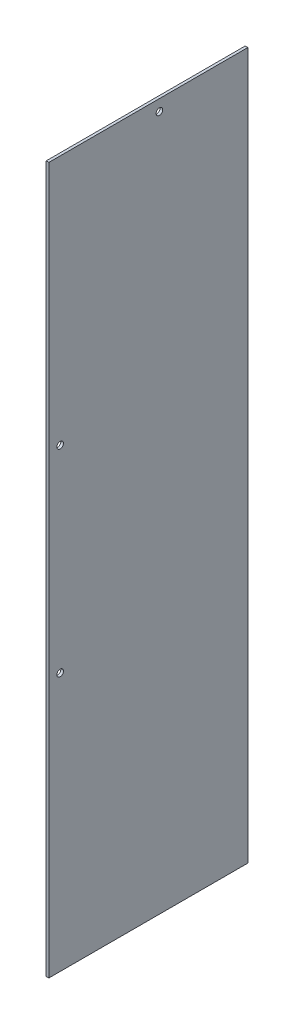
ISO-10303-21;
HEADER;
FILE_DESCRIPTION(('STEP AP214'),'2;1');
FILE_NAME('part.step','',(''),(''),'','','');
FILE_SCHEMA(('AUTOMOTIVE_DESIGN { 1 0 10303 214 1 1 1 1 }'));
ENDSEC;
DATA;
#1=APPLICATION_CONTEXT('core data for automotive mechanical design processes');
#2=APPLICATION_PROTOCOL_DEFINITION('international standard','automotive_design',2000,#1);
#3=PRODUCT_CONTEXT('',#1,'mechanical');
#4=PRODUCT('Part','Part','',(#3));
#5=PRODUCT_RELATED_PRODUCT_CATEGORY('part','',(#4));
#6=PRODUCT_DEFINITION_FORMATION('','',#4);
#7=PRODUCT_DEFINITION_CONTEXT('part definition',#1,'design');
#8=PRODUCT_DEFINITION('design','',#6,#7);
#9=PRODUCT_DEFINITION_SHAPE('','',#8);
#10=(LENGTH_UNIT() NAMED_UNIT(*) SI_UNIT(.MILLI.,.METRE.));
#11=(NAMED_UNIT(*) PLANE_ANGLE_UNIT() SI_UNIT($,.RADIAN.));
#12=(NAMED_UNIT(*) SI_UNIT($,.STERADIAN.) SOLID_ANGLE_UNIT());
#13=UNCERTAINTY_MEASURE_WITH_UNIT(LENGTH_MEASURE(1.E-05),#10,'distance_accuracy_value','');
#14=(GEOMETRIC_REPRESENTATION_CONTEXT(3) GLOBAL_UNCERTAINTY_ASSIGNED_CONTEXT((#13)) GLOBAL_UNIT_ASSIGNED_CONTEXT((#10,
#11,#12)) REPRESENTATION_CONTEXT('',''));
#15=CARTESIAN_POINT('',(0.,0.,0.));
#16=DIRECTION('',(0.,0.,1.));
#17=DIRECTION('',(1.,0.,0.));
#18=AXIS2_PLACEMENT_3D('',#15,#16,#17);
#19=CARTESIAN_POINT('',(3.0734,-406.5905,114.4905));
#20=DIRECTION('',(0.,0.,-1.));
#21=DIRECTION('',(-1.,0.,0.));
#22=AXIS2_PLACEMENT_3D('',#19,#20,#21);
#23=PLANE('',#22);
#24=DIRECTION('',(0.,-1.,0.));
#25=VECTOR('',#24,1.);
#26=CARTESIAN_POINT('',(0.,-406.5905,114.4905));
#27=LINE('',#26,#25);
#28=CARTESIAN_POINT('',(0.,406.5905,114.4905));
#29=VERTEX_POINT('',#28);
#30=CARTESIAN_POINT('',(0.,-406.5905,114.4905));
#31=VERTEX_POINT('',#30);
#32=EDGE_CURVE('E96',#29,#31,#27,.T.);
#33=ORIENTED_EDGE('',*,*,#32,.T.);
#34=DIRECTION('',(-1.,0.,0.));
#35=VECTOR('',#34,1.);
#36=CARTESIAN_POINT('',(3.0734,-406.5905,114.4905));
#37=LINE('',#36,#35);
#38=CARTESIAN_POINT('',(3.0734,-406.5905,114.4905));
#39=VERTEX_POINT('',#38);
#40=EDGE_CURVE('E11',#39,#31,#37,.T.);
#41=ORIENTED_EDGE('',*,*,#40,.F.);
#42=DIRECTION('',(0.,-1.,0.));
#43=VECTOR('',#42,1.);
#44=CARTESIAN_POINT('',(3.0734,-406.5905,114.4905));
#45=LINE('',#44,#43);
#46=CARTESIAN_POINT('',(3.0734,406.5905,114.4905));
#47=VERTEX_POINT('',#46);
#48=EDGE_CURVE('E84',#47,#39,#45,.T.);
#49=ORIENTED_EDGE('',*,*,#48,.F.);
#50=DIRECTION('',(-1.,0.,0.));
#51=VECTOR('',#50,1.);
#52=CARTESIAN_POINT('',(3.0734,406.5905,114.4905));
#53=LINE('',#52,#51);
#54=EDGE_CURVE('E92',#47,#29,#53,.T.);
#55=ORIENTED_EDGE('',*,*,#54,.T.);
#56=EDGE_LOOP('',(#33,#41,#49,#55));
#57=FACE_BOUND('',#56,.T.);
#58=ADVANCED_FACE('F33',(#57),#23,.F.);
#59=CARTESIAN_POINT('',(3.0734,-406.5905,-114.4905));
#60=DIRECTION('',(0.,1.,0.));
#61=DIRECTION('',(0.,0.,1.));
#62=AXIS2_PLACEMENT_3D('',#59,#60,#61);
#63=PLANE('',#62);
#64=DIRECTION('',(0.,0.,-1.));
#65=VECTOR('',#64,1.);
#66=CARTESIAN_POINT('',(0.,-406.5905,-114.4905));
#67=LINE('',#66,#65);
#68=CARTESIAN_POINT('',(0.,-406.5905,-114.4905));
#69=VERTEX_POINT('',#68);
#70=EDGE_CURVE('E88',#31,#69,#67,.T.);
#71=ORIENTED_EDGE('',*,*,#70,.T.);
#72=DIRECTION('',(-1.,0.,0.));
#73=VECTOR('',#72,1.);
#74=CARTESIAN_POINT('',(3.0734,-406.5905,-114.4905));
#75=LINE('',#74,#73);
#76=CARTESIAN_POINT('',(3.0734,-406.5905,-114.4905));
#77=VERTEX_POINT('',#76);
#78=EDGE_CURVE('E41',#77,#69,#75,.T.);
#79=ORIENTED_EDGE('',*,*,#78,.F.);
#80=DIRECTION('',(0.,0.,-1.));
#81=VECTOR('',#80,1.);
#82=CARTESIAN_POINT('',(3.0734,-406.5905,-114.4905));
#83=LINE('',#82,#81);
#84=EDGE_CURVE('E79',#39,#77,#83,.T.);
#85=ORIENTED_EDGE('',*,*,#84,.F.);
#86=ORIENTED_EDGE('',*,*,#40,.T.);
#87=EDGE_LOOP('',(#71,#79,#85,#86));
#88=FACE_BOUND('',#87,.T.);
#89=ADVANCED_FACE('F87',(#88),#63,.F.);
#90=CARTESIAN_POINT('',(3.0734,-406.5905,-114.4905));
#91=DIRECTION('',(0.,0.,1.));
#92=DIRECTION('',(1.,0.,0.));
#93=AXIS2_PLACEMENT_3D('',#90,#91,#92);
#94=PLANE('',#93);
#95=DIRECTION('',(0.,1.,0.));
#96=VECTOR('',#95,1.);
#97=CARTESIAN_POINT('',(0.,-406.5905,-114.4905));
#98=LINE('',#97,#96);
#99=CARTESIAN_POINT('',(0.,406.5905,-114.4905));
#100=VERTEX_POINT('',#99);
#101=EDGE_CURVE('E66',#69,#100,#98,.T.);
#102=ORIENTED_EDGE('',*,*,#101,.T.);
#103=DIRECTION('',(-1.,0.,0.));
#104=VECTOR('',#103,1.);
#105=CARTESIAN_POINT('',(3.0734,406.5905,-114.4905));
#106=LINE('',#105,#104);
#107=CARTESIAN_POINT('',(3.0734,406.5905,-114.4905));
#108=VERTEX_POINT('',#107);
#109=EDGE_CURVE('E89',#108,#100,#106,.T.);
#110=ORIENTED_EDGE('',*,*,#109,.F.);
#111=DIRECTION('',(0.,1.,0.));
#112=VECTOR('',#111,1.);
#113=CARTESIAN_POINT('',(3.0734,-406.5905,-114.4905));
#114=LINE('',#113,#112);
#115=EDGE_CURVE('E82',#77,#108,#114,.T.);
#116=ORIENTED_EDGE('',*,*,#115,.F.);
#117=ORIENTED_EDGE('',*,*,#78,.T.);
#118=EDGE_LOOP('',(#102,#110,#116,#117));
#119=FACE_BOUND('',#118,.T.);
#120=ADVANCED_FACE('F90',(#119),#94,.F.);
#121=CARTESIAN_POINT('',(3.0734,406.5905,-114.4905));
#122=DIRECTION('',(0.,-1.,0.));
#123=DIRECTION('',(0.,0.,-1.));
#124=AXIS2_PLACEMENT_3D('',#121,#122,#123);
#125=PLANE('',#124);
#126=DIRECTION('',(0.,0.,1.));
#127=VECTOR('',#126,1.);
#128=CARTESIAN_POINT('',(0.,406.5905,-114.4905));
#129=LINE('',#128,#127);
#130=EDGE_CURVE('E72',#100,#29,#129,.T.);
#131=ORIENTED_EDGE('',*,*,#130,.T.);
#132=ORIENTED_EDGE('',*,*,#54,.F.);
#133=DIRECTION('',(0.,0.,1.));
#134=VECTOR('',#133,1.);
#135=CARTESIAN_POINT('',(3.0734,406.5905,-114.4905));
#136=LINE('',#135,#134);
#137=EDGE_CURVE('E49',#108,#47,#136,.T.);
#138=ORIENTED_EDGE('',*,*,#137,.F.);
#139=ORIENTED_EDGE('',*,*,#109,.T.);
#140=EDGE_LOOP('',(#131,#132,#138,#139));
#141=FACE_BOUND('',#140,.T.);
#142=ADVANCED_FACE('F104',(#141),#125,.F.);
#143=CARTESIAN_POINT('',(3.0734,0.,0.));
#144=DIRECTION('',(1.,0.,0.));
#145=DIRECTION('',(0.,0.,-1.));
#146=AXIS2_PLACEMENT_3D('',#143,#144,#145);
#147=PLANE('',#146);
#148=CARTESIAN_POINT('',(3.0734,118.165033333333,101.5111));
#149=DIRECTION('',(1.,0.,0.));
#150=DIRECTION('',(0.,0.,-1.));
#151=AXIS2_PLACEMENT_3D('',#148,#149,#150);
#152=CIRCLE('',#151,3.81);
#153=CARTESIAN_POINT('',(3.0734,118.165033333333,97.7011));
#154=VERTEX_POINT('',#153);
#155=EDGE_CURVE('E119',#154,#154,#152,.T.);
#156=ORIENTED_EDGE('',*,*,#155,.F.);
#157=EDGE_LOOP('',(#156));
#158=FACE_BOUND('',#157,.T.);
#159=CARTESIAN_POINT('',(3.0734,-108.919433333333,101.5111));
#160=DIRECTION('',(1.,0.,0.));
#161=DIRECTION('',(0.,0.,-1.));
#162=AXIS2_PLACEMENT_3D('',#159,#160,#161);
#163=CIRCLE('',#162,3.81);
#164=CARTESIAN_POINT('',(3.0734,-108.919433333333,97.7011));
#165=VERTEX_POINT('',#164);
#166=EDGE_CURVE('E120',#165,#165,#163,.T.);
#167=ORIENTED_EDGE('',*,*,#166,.F.);
#168=EDGE_LOOP('',(#167));
#169=FACE_BOUND('',#168,.T.);
#170=CARTESIAN_POINT('',(3.0734,393.6111,-12.7889));
#171=DIRECTION('',(1.,0.,0.));
#172=DIRECTION('',(0.,0.,-1.));
#173=AXIS2_PLACEMENT_3D('',#170,#171,#172);
#174=CIRCLE('',#173,3.80999999999999);
#175=CARTESIAN_POINT('',(3.0734,393.6111,-16.5989));
#176=VERTEX_POINT('',#175);
#177=EDGE_CURVE('E112',#176,#176,#174,.T.);
#178=ORIENTED_EDGE('',*,*,#177,.F.);
#179=EDGE_LOOP('',(#178));
#180=FACE_BOUND('',#179,.T.);
#181=ORIENTED_EDGE('',*,*,#48,.T.);
#182=ORIENTED_EDGE('',*,*,#84,.T.);
#183=ORIENTED_EDGE('',*,*,#115,.T.);
#184=ORIENTED_EDGE('',*,*,#137,.T.);
#185=EDGE_LOOP('',(#181,#182,#183,#184));
#186=FACE_BOUND('',#185,.T.);
#187=ADVANCED_FACE('F80',(#158,#169,#180,#186),#147,.T.);
#188=CARTESIAN_POINT('',(0.,0.,0.));
#189=DIRECTION('',(1.,0.,0.));
#190=DIRECTION('',(0.,0.,-1.));
#191=AXIS2_PLACEMENT_3D('',#188,#189,#190);
#192=PLANE('',#191);
#193=CARTESIAN_POINT('',(0.,118.165033333333,101.5111));
#194=DIRECTION('',(1.,0.,0.));
#195=DIRECTION('',(0.,0.,-1.));
#196=AXIS2_PLACEMENT_3D('',#193,#194,#195);
#197=CIRCLE('',#196,3.81);
#198=CARTESIAN_POINT('',(0.,118.165033333333,97.7011));
#199=VERTEX_POINT('',#198);
#200=EDGE_CURVE('E115',#199,#199,#197,.F.);
#201=ORIENTED_EDGE('',*,*,#200,.F.);
#202=EDGE_LOOP('',(#201));
#203=FACE_BOUND('',#202,.T.);
#204=CARTESIAN_POINT('',(0.,-108.919433333333,101.5111));
#205=DIRECTION('',(1.,0.,0.));
#206=DIRECTION('',(0.,0.,-1.));
#207=AXIS2_PLACEMENT_3D('',#204,#205,#206);
#208=CIRCLE('',#207,3.81);
#209=CARTESIAN_POINT('',(0.,-108.919433333333,97.7011));
#210=VERTEX_POINT('',#209);
#211=EDGE_CURVE('E116',#210,#210,#208,.F.);
#212=ORIENTED_EDGE('',*,*,#211,.F.);
#213=EDGE_LOOP('',(#212));
#214=FACE_BOUND('',#213,.T.);
#215=CARTESIAN_POINT('',(0.,393.6111,-12.7889));
#216=DIRECTION('',(1.,0.,0.));
#217=DIRECTION('',(0.,0.,-1.));
#218=AXIS2_PLACEMENT_3D('',#215,#216,#217);
#219=CIRCLE('',#218,3.80999999999999);
#220=CARTESIAN_POINT('',(0.,393.6111,-16.5989));
#221=VERTEX_POINT('',#220);
#222=EDGE_CURVE('E99',#221,#221,#219,.F.);
#223=ORIENTED_EDGE('',*,*,#222,.F.);
#224=EDGE_LOOP('',(#223));
#225=FACE_BOUND('',#224,.T.);
#226=ORIENTED_EDGE('',*,*,#32,.F.);
#227=ORIENTED_EDGE('',*,*,#130,.F.);
#228=ORIENTED_EDGE('',*,*,#101,.F.);
#229=ORIENTED_EDGE('',*,*,#70,.F.);
#230=EDGE_LOOP('',(#226,#227,#228,#229));
#231=FACE_BOUND('',#230,.T.);
#232=ADVANCED_FACE('F107',(#203,#214,#225,#231),#192,.F.);
#233=CARTESIAN_POINT('',(-0.00100000000000013,393.6111,-12.7889));
#234=DIRECTION('',(1.,0.,0.));
#235=DIRECTION('',(0.,0.,-1.));
#236=AXIS2_PLACEMENT_3D('',#233,#234,#235);
#237=CYLINDRICAL_SURFACE('',#236,3.80999999999999);
#238=ORIENTED_EDGE('',*,*,#177,.T.);
#239=EDGE_LOOP('',(#238));
#240=FACE_BOUND('',#239,.T.);
#241=ORIENTED_EDGE('',*,*,#222,.T.);
#242=EDGE_LOOP('',(#241));
#243=FACE_BOUND('',#242,.T.);
#244=ADVANCED_FACE('F138',(#240,#243),#237,.F.);
#245=CARTESIAN_POINT('',(-0.00100000000000013,-108.919433333333,101.5111));
#246=DIRECTION('',(1.,0.,0.));
#247=DIRECTION('',(0.,0.,-1.));
#248=AXIS2_PLACEMENT_3D('',#245,#246,#247);
#249=CYLINDRICAL_SURFACE('',#248,3.81);
#250=ORIENTED_EDGE('',*,*,#166,.T.);
#251=EDGE_LOOP('',(#250));
#252=FACE_BOUND('',#251,.T.);
#253=ORIENTED_EDGE('',*,*,#211,.T.);
#254=EDGE_LOOP('',(#253));
#255=FACE_BOUND('',#254,.T.);
#256=ADVANCED_FACE('F141',(#252,#255),#249,.F.);
#257=CARTESIAN_POINT('',(-0.00100000000000013,118.165033333333,101.5111));
#258=DIRECTION('',(1.,0.,0.));
#259=DIRECTION('',(0.,0.,-1.));
#260=AXIS2_PLACEMENT_3D('',#257,#258,#259);
#261=CYLINDRICAL_SURFACE('',#260,3.81);
#262=ORIENTED_EDGE('',*,*,#155,.T.);
#263=EDGE_LOOP('',(#262));
#264=FACE_BOUND('',#263,.T.);
#265=ORIENTED_EDGE('',*,*,#200,.T.);
#266=EDGE_LOOP('',(#265));
#267=FACE_BOUND('',#266,.T.);
#268=ADVANCED_FACE('F128',(#264,#267),#261,.F.);
#269=CLOSED_SHELL('',(#58,#89,#120,#142,#187,#232,#244,#256,#268));
#270=MANIFOLD_SOLID_BREP('B2',#269);
#271=ADVANCED_BREP_SHAPE_REPRESENTATION('',(#18,#270),#14);
#272=SHAPE_DEFINITION_REPRESENTATION(#9,#271);
ENDSEC;
END-ISO-10303-21;
